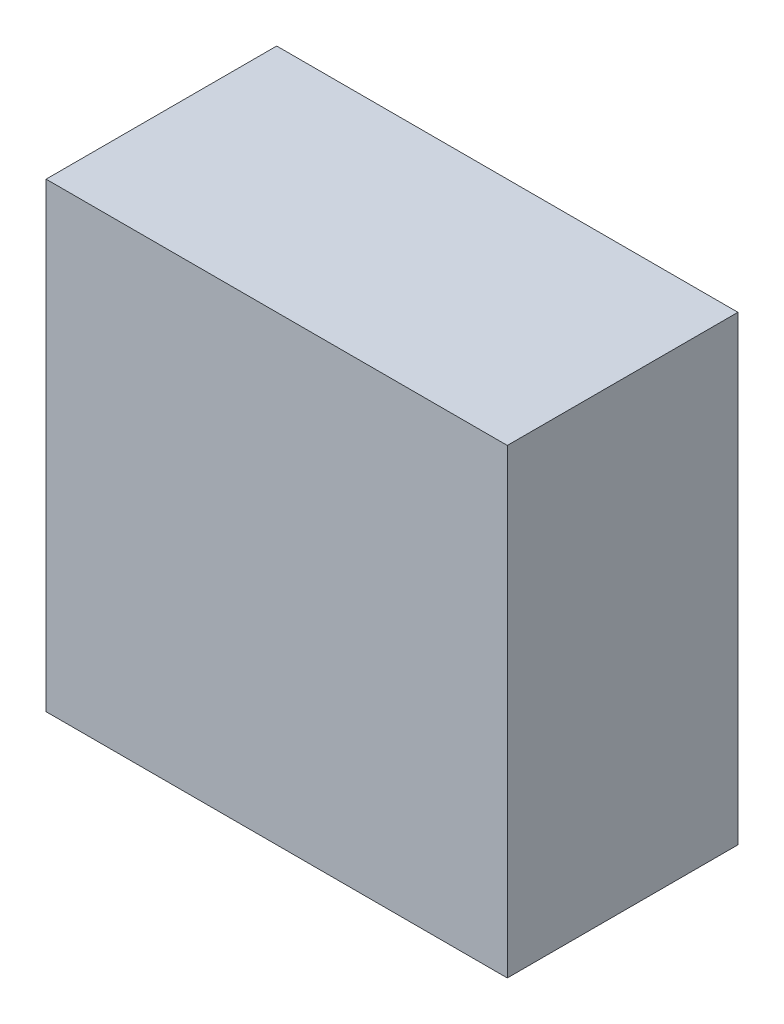
ISO-10303-21;
HEADER;
FILE_DESCRIPTION(('STEP AP214'),'2;1');
FILE_NAME('part.step','',(''),(''),'','','');
FILE_SCHEMA(('AUTOMOTIVE_DESIGN { 1 0 10303 214 1 1 1 1 }'));
ENDSEC;
DATA;
#1=APPLICATION_CONTEXT('core data for automotive mechanical design processes');
#2=APPLICATION_PROTOCOL_DEFINITION('international standard','automotive_design',2000,#1);
#3=PRODUCT_CONTEXT('',#1,'mechanical');
#4=PRODUCT('Part','Part','',(#3));
#5=PRODUCT_RELATED_PRODUCT_CATEGORY('part','',(#4));
#6=PRODUCT_DEFINITION_FORMATION('','',#4);
#7=PRODUCT_DEFINITION_CONTEXT('part definition',#1,'design');
#8=PRODUCT_DEFINITION('design','',#6,#7);
#9=PRODUCT_DEFINITION_SHAPE('','',#8);
#10=(LENGTH_UNIT() NAMED_UNIT(*) SI_UNIT(.MILLI.,.METRE.));
#11=(NAMED_UNIT(*) PLANE_ANGLE_UNIT() SI_UNIT($,.RADIAN.));
#12=(NAMED_UNIT(*) SI_UNIT($,.STERADIAN.) SOLID_ANGLE_UNIT());
#13=UNCERTAINTY_MEASURE_WITH_UNIT(LENGTH_MEASURE(1.E-05),#10,'distance_accuracy_value','');
#14=(GEOMETRIC_REPRESENTATION_CONTEXT(3) GLOBAL_UNCERTAINTY_ASSIGNED_CONTEXT((#13)) GLOBAL_UNIT_ASSIGNED_CONTEXT((#10,
#11,#12)) REPRESENTATION_CONTEXT('',''));
#15=CARTESIAN_POINT('',(0.,0.,0.));
#16=DIRECTION('',(0.,0.,1.));
#17=DIRECTION('',(1.,0.,0.));
#18=AXIS2_PLACEMENT_3D('',#15,#16,#17);
#19=CARTESIAN_POINT('',(-200.,400.,-100.));
#20=DIRECTION('',(1.,0.,0.));
#21=DIRECTION('',(0.,0.,-1.));
#22=AXIS2_PLACEMENT_3D('',#19,#20,#21);
#23=PLANE('',#22);
#24=DIRECTION('',(0.,0.,1.));
#25=VECTOR('',#24,1.);
#26=CARTESIAN_POINT('',(-200.,0.,-100.));
#27=LINE('',#26,#25);
#28=CARTESIAN_POINT('',(-200.,0.,-100.));
#29=VERTEX_POINT('',#28);
#30=CARTESIAN_POINT('',(-200.,0.,100.));
#31=VERTEX_POINT('',#30);
#32=EDGE_CURVE('E96',#29,#31,#27,.T.);
#33=ORIENTED_EDGE('',*,*,#32,.T.);
#34=DIRECTION('',(0.,-1.,0.));
#35=VECTOR('',#34,1.);
#36=CARTESIAN_POINT('',(-200.,400.,100.));
#37=LINE('',#36,#35);
#38=CARTESIAN_POINT('',(-200.,400.,100.));
#39=VERTEX_POINT('',#38);
#40=EDGE_CURVE('E11',#39,#31,#37,.T.);
#41=ORIENTED_EDGE('',*,*,#40,.F.);
#42=DIRECTION('',(0.,0.,1.));
#43=VECTOR('',#42,1.);
#44=CARTESIAN_POINT('',(-200.,400.,-100.));
#45=LINE('',#44,#43);
#46=CARTESIAN_POINT('',(-200.,400.,-100.));
#47=VERTEX_POINT('',#46);
#48=EDGE_CURVE('E84',#47,#39,#45,.T.);
#49=ORIENTED_EDGE('',*,*,#48,.F.);
#50=DIRECTION('',(0.,-1.,0.));
#51=VECTOR('',#50,1.);
#52=CARTESIAN_POINT('',(-200.,400.,-100.));
#53=LINE('',#52,#51);
#54=EDGE_CURVE('E92',#47,#29,#53,.T.);
#55=ORIENTED_EDGE('',*,*,#54,.T.);
#56=EDGE_LOOP('',(#33,#41,#49,#55));
#57=FACE_BOUND('',#56,.T.);
#58=ADVANCED_FACE('F33',(#57),#23,.F.);
#59=CARTESIAN_POINT('',(-200.,400.,100.));
#60=DIRECTION('',(0.,0.,-1.));
#61=DIRECTION('',(-1.,0.,0.));
#62=AXIS2_PLACEMENT_3D('',#59,#60,#61);
#63=PLANE('',#62);
#64=DIRECTION('',(1.,0.,0.));
#65=VECTOR('',#64,1.);
#66=CARTESIAN_POINT('',(-200.,0.,100.));
#67=LINE('',#66,#65);
#68=CARTESIAN_POINT('',(200.,0.,100.));
#69=VERTEX_POINT('',#68);
#70=EDGE_CURVE('E88',#31,#69,#67,.T.);
#71=ORIENTED_EDGE('',*,*,#70,.T.);
#72=DIRECTION('',(0.,-1.,0.));
#73=VECTOR('',#72,1.);
#74=CARTESIAN_POINT('',(200.,400.,100.));
#75=LINE('',#74,#73);
#76=CARTESIAN_POINT('',(200.,400.,100.));
#77=VERTEX_POINT('',#76);
#78=EDGE_CURVE('E41',#77,#69,#75,.T.);
#79=ORIENTED_EDGE('',*,*,#78,.F.);
#80=DIRECTION('',(1.,0.,0.));
#81=VECTOR('',#80,1.);
#82=CARTESIAN_POINT('',(-200.,400.,100.));
#83=LINE('',#82,#81);
#84=EDGE_CURVE('E79',#39,#77,#83,.T.);
#85=ORIENTED_EDGE('',*,*,#84,.F.);
#86=ORIENTED_EDGE('',*,*,#40,.T.);
#87=EDGE_LOOP('',(#71,#79,#85,#86));
#88=FACE_BOUND('',#87,.T.);
#89=ADVANCED_FACE('F87',(#88),#63,.F.);
#90=CARTESIAN_POINT('',(200.,400.,-100.));
#91=DIRECTION('',(-1.,0.,0.));
#92=DIRECTION('',(0.,0.,1.));
#93=AXIS2_PLACEMENT_3D('',#90,#91,#92);
#94=PLANE('',#93);
#95=DIRECTION('',(0.,0.,-1.));
#96=VECTOR('',#95,1.);
#97=CARTESIAN_POINT('',(200.,0.,-100.));
#98=LINE('',#97,#96);
#99=CARTESIAN_POINT('',(200.,0.,-100.));
#100=VERTEX_POINT('',#99);
#101=EDGE_CURVE('E66',#69,#100,#98,.T.);
#102=ORIENTED_EDGE('',*,*,#101,.T.);
#103=DIRECTION('',(0.,-1.,0.));
#104=VECTOR('',#103,1.);
#105=CARTESIAN_POINT('',(200.,400.,-100.));
#106=LINE('',#105,#104);
#107=CARTESIAN_POINT('',(200.,400.,-100.));
#108=VERTEX_POINT('',#107);
#109=EDGE_CURVE('E89',#108,#100,#106,.T.);
#110=ORIENTED_EDGE('',*,*,#109,.F.);
#111=DIRECTION('',(0.,0.,-1.));
#112=VECTOR('',#111,1.);
#113=CARTESIAN_POINT('',(200.,400.,-100.));
#114=LINE('',#113,#112);
#115=EDGE_CURVE('E82',#77,#108,#114,.T.);
#116=ORIENTED_EDGE('',*,*,#115,.F.);
#117=ORIENTED_EDGE('',*,*,#78,.T.);
#118=EDGE_LOOP('',(#102,#110,#116,#117));
#119=FACE_BOUND('',#118,.T.);
#120=ADVANCED_FACE('F90',(#119),#94,.F.);
#121=CARTESIAN_POINT('',(-200.,400.,-100.));
#122=DIRECTION('',(0.,0.,1.));
#123=DIRECTION('',(1.,0.,0.));
#124=AXIS2_PLACEMENT_3D('',#121,#122,#123);
#125=PLANE('',#124);
#126=DIRECTION('',(-1.,0.,0.));
#127=VECTOR('',#126,1.);
#128=CARTESIAN_POINT('',(-200.,0.,-100.));
#129=LINE('',#128,#127);
#130=EDGE_CURVE('E72',#100,#29,#129,.T.);
#131=ORIENTED_EDGE('',*,*,#130,.T.);
#132=ORIENTED_EDGE('',*,*,#54,.F.);
#133=DIRECTION('',(-1.,0.,0.));
#134=VECTOR('',#133,1.);
#135=CARTESIAN_POINT('',(-200.,400.,-100.));
#136=LINE('',#135,#134);
#137=EDGE_CURVE('E49',#108,#47,#136,.T.);
#138=ORIENTED_EDGE('',*,*,#137,.F.);
#139=ORIENTED_EDGE('',*,*,#109,.T.);
#140=EDGE_LOOP('',(#131,#132,#138,#139));
#141=FACE_BOUND('',#140,.T.);
#142=ADVANCED_FACE('F103',(#141),#125,.F.);
#143=CARTESIAN_POINT('',(0.,400.,0.));
#144=DIRECTION('',(0.,1.,0.));
#145=DIRECTION('',(0.,0.,1.));
#146=AXIS2_PLACEMENT_3D('',#143,#144,#145);
#147=PLANE('',#146);
#148=ORIENTED_EDGE('',*,*,#48,.T.);
#149=ORIENTED_EDGE('',*,*,#84,.T.);
#150=ORIENTED_EDGE('',*,*,#115,.T.);
#151=ORIENTED_EDGE('',*,*,#137,.T.);
#152=EDGE_LOOP('',(#148,#149,#150,#151));
#153=FACE_BOUND('',#152,.T.);
#154=ADVANCED_FACE('F80',(#153),#147,.T.);
#155=CARTESIAN_POINT('',(0.,0.,0.));
#156=DIRECTION('',(0.,1.,0.));
#157=DIRECTION('',(0.,0.,1.));
#158=AXIS2_PLACEMENT_3D('',#155,#156,#157);
#159=PLANE('',#158);
#160=ORIENTED_EDGE('',*,*,#32,.F.);
#161=ORIENTED_EDGE('',*,*,#130,.F.);
#162=ORIENTED_EDGE('',*,*,#101,.F.);
#163=ORIENTED_EDGE('',*,*,#70,.F.);
#164=EDGE_LOOP('',(#160,#161,#162,#163));
#165=FACE_BOUND('',#164,.T.);
#166=ADVANCED_FACE('F106',(#165),#159,.F.);
#167=CLOSED_SHELL('',(#58,#89,#120,#142,#154,#166));
#168=MANIFOLD_SOLID_BREP('B2',#167);
#169=ADVANCED_BREP_SHAPE_REPRESENTATION('',(#18,#168),#14);
#170=SHAPE_DEFINITION_REPRESENTATION(#9,#169);
ENDSEC;
END-ISO-10303-21;
